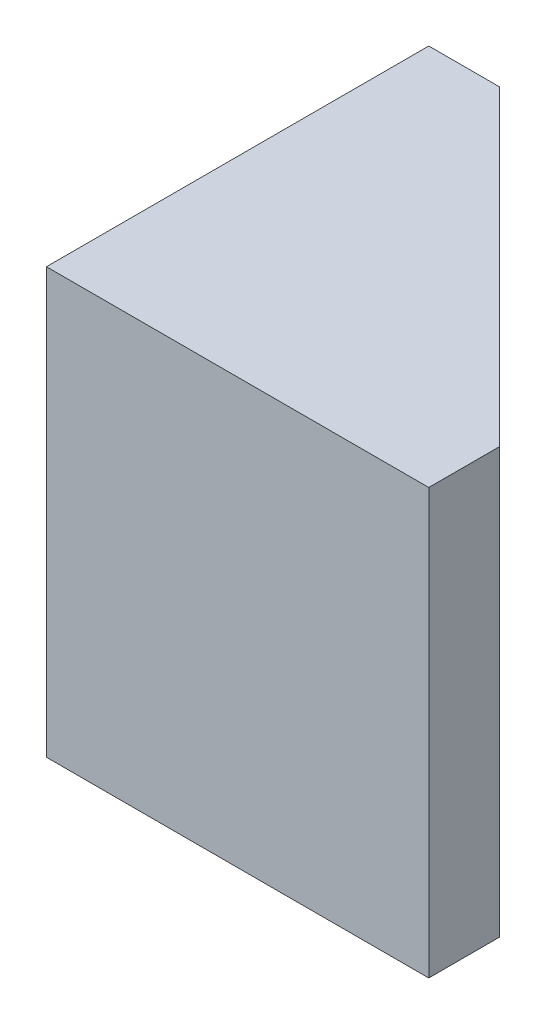
ISO-10303-21;
HEADER;
FILE_DESCRIPTION(('STEP AP214'),'2;1');
FILE_NAME('part.step','',(''),(''),'','','');
FILE_SCHEMA(('AUTOMOTIVE_DESIGN { 1 0 10303 214 1 1 1 1 }'));
ENDSEC;
DATA;
#1=APPLICATION_CONTEXT('core data for automotive mechanical design processes');
#2=APPLICATION_PROTOCOL_DEFINITION('international standard','automotive_design',2000,#1);
#3=PRODUCT_CONTEXT('',#1,'mechanical');
#4=PRODUCT('Part','Part','',(#3));
#5=PRODUCT_RELATED_PRODUCT_CATEGORY('part','',(#4));
#6=PRODUCT_DEFINITION_FORMATION('','',#4);
#7=PRODUCT_DEFINITION_CONTEXT('part definition',#1,'design');
#8=PRODUCT_DEFINITION('design','',#6,#7);
#9=PRODUCT_DEFINITION_SHAPE('','',#8);
#10=(LENGTH_UNIT() NAMED_UNIT(*) SI_UNIT(.MILLI.,.METRE.));
#11=(NAMED_UNIT(*) PLANE_ANGLE_UNIT() SI_UNIT($,.RADIAN.));
#12=(NAMED_UNIT(*) SI_UNIT($,.STERADIAN.) SOLID_ANGLE_UNIT());
#13=UNCERTAINTY_MEASURE_WITH_UNIT(LENGTH_MEASURE(1.E-05),#10,'distance_accuracy_value','');
#14=(GEOMETRIC_REPRESENTATION_CONTEXT(3) GLOBAL_UNCERTAINTY_ASSIGNED_CONTEXT((#13)) GLOBAL_UNIT_ASSIGNED_CONTEXT((#10,
#11,#12)) REPRESENTATION_CONTEXT('',''));
#15=CARTESIAN_POINT('',(0.,0.,0.));
#16=DIRECTION('',(0.,0.,1.));
#17=DIRECTION('',(1.,0.,0.));
#18=AXIS2_PLACEMENT_3D('',#15,#16,#17);
#19=CARTESIAN_POINT('',(32.,30.,0.));
#20=DIRECTION('',(0.,0.,-1.));
#21=DIRECTION('',(-1.,0.,0.));
#22=AXIS2_PLACEMENT_3D('',#19,#20,#21);
#23=PLANE('',#22);
#24=DIRECTION('',(1.,0.,0.));
#25=VECTOR('',#24,1.);
#26=CARTESIAN_POINT('',(32.,0.,0.));
#27=LINE('',#26,#25);
#28=CARTESIAN_POINT('',(0.,0.,0.));
#29=VERTEX_POINT('',#28);
#30=CARTESIAN_POINT('',(27.,0.,0.));
#31=VERTEX_POINT('',#30);
#32=EDGE_CURVE('E109',#29,#31,#27,.T.);
#33=ORIENTED_EDGE('',*,*,#32,.T.);
#34=DIRECTION('',(0.,1.,0.));
#35=VECTOR('',#34,1.);
#36=CARTESIAN_POINT('',(27.,0.,0.));
#37=LINE('',#36,#35);
#38=CARTESIAN_POINT('',(27.,30.,0.));
#39=VERTEX_POINT('',#38);
#40=EDGE_CURVE('E66',#31,#39,#37,.T.);
#41=ORIENTED_EDGE('',*,*,#40,.T.);
#42=DIRECTION('',(1.,0.,0.));
#43=VECTOR('',#42,1.);
#44=CARTESIAN_POINT('',(32.,30.,0.));
#45=LINE('',#44,#43);
#46=CARTESIAN_POINT('',(0.,30.,0.));
#47=VERTEX_POINT('',#46);
#48=EDGE_CURVE('E111',#47,#39,#45,.T.);
#49=ORIENTED_EDGE('',*,*,#48,.F.);
#50=DIRECTION('',(0.,-1.,0.));
#51=VECTOR('',#50,1.);
#52=CARTESIAN_POINT('',(0.,30.,0.));
#53=LINE('',#52,#51);
#54=EDGE_CURVE('E11',#47,#29,#53,.T.);
#55=ORIENTED_EDGE('',*,*,#54,.T.);
#56=EDGE_LOOP('',(#33,#41,#49,#55));
#57=FACE_BOUND('',#56,.T.);
#58=ADVANCED_FACE('F43',(#57),#23,.F.);
#59=CARTESIAN_POINT('',(0.,30.,-32.));
#60=DIRECTION('',(-0.707106781186547,0.,0.707106781186547));
#61=DIRECTION('',(0.707106781186548,0.,0.707106781186548));
#62=AXIS2_PLACEMENT_3D('',#59,#60,#61);
#63=PLANE('',#62);
#64=DIRECTION('',(-0.707106781186548,0.,-0.707106781186548));
#65=VECTOR('',#64,1.);
#66=CARTESIAN_POINT('',(0.,0.,-32.));
#67=LINE('',#66,#65);
#68=CARTESIAN_POINT('',(27.,0.,-5.0000000000001));
#69=VERTEX_POINT('',#68);
#70=CARTESIAN_POINT('',(5.,0.,-27.));
#71=VERTEX_POINT('',#70);
#72=EDGE_CURVE('E112',#69,#71,#67,.T.);
#73=ORIENTED_EDGE('',*,*,#72,.T.);
#74=DIRECTION('',(0.,1.,0.));
#75=VECTOR('',#74,1.);
#76=CARTESIAN_POINT('',(5.,0.,-27.));
#77=LINE('',#76,#75);
#78=CARTESIAN_POINT('',(5.,30.,-27.));
#79=VERTEX_POINT('',#78);
#80=EDGE_CURVE('E58',#71,#79,#77,.T.);
#81=ORIENTED_EDGE('',*,*,#80,.T.);
#82=DIRECTION('',(-0.707106781186548,0.,-0.707106781186548));
#83=VECTOR('',#82,1.);
#84=CARTESIAN_POINT('',(0.,30.,-32.));
#85=LINE('',#84,#83);
#86=CARTESIAN_POINT('',(27.,30.,-5.0000000000001));
#87=VERTEX_POINT('',#86);
#88=EDGE_CURVE('E116',#87,#79,#85,.T.);
#89=ORIENTED_EDGE('',*,*,#88,.F.);
#90=DIRECTION('',(0.,1.,0.));
#91=VECTOR('',#90,1.);
#92=CARTESIAN_POINT('',(27.,0.,-5.0000000000001));
#93=LINE('',#92,#91);
#94=EDGE_CURVE('E133',#69,#87,#93,.T.);
#95=ORIENTED_EDGE('',*,*,#94,.F.);
#96=EDGE_LOOP('',(#73,#81,#89,#95));
#97=FACE_BOUND('',#96,.T.);
#98=ADVANCED_FACE('F144',(#97),#63,.F.);
#99=CARTESIAN_POINT('',(0.,30.,0.));
#100=DIRECTION('',(1.,0.,0.));
#101=DIRECTION('',(0.,0.,-1.));
#102=AXIS2_PLACEMENT_3D('',#99,#100,#101);
#103=PLANE('',#102);
#104=DIRECTION('',(0.,0.,1.));
#105=VECTOR('',#104,1.);
#106=CARTESIAN_POINT('',(0.,30.,0.));
#107=LINE('',#106,#105);
#108=CARTESIAN_POINT('',(0.,30.,-27.));
#109=VERTEX_POINT('',#108);
#110=EDGE_CURVE('E51',#109,#47,#107,.T.);
#111=ORIENTED_EDGE('',*,*,#110,.F.);
#112=DIRECTION('',(0.,1.,0.));
#113=VECTOR('',#112,1.);
#114=CARTESIAN_POINT('',(0.,0.,-27.));
#115=LINE('',#114,#113);
#116=CARTESIAN_POINT('',(0.,0.,-27.));
#117=VERTEX_POINT('',#116);
#118=EDGE_CURVE('E90',#117,#109,#115,.T.);
#119=ORIENTED_EDGE('',*,*,#118,.F.);
#120=DIRECTION('',(0.,0.,1.));
#121=VECTOR('',#120,1.);
#122=CARTESIAN_POINT('',(0.,0.,0.));
#123=LINE('',#122,#121);
#124=EDGE_CURVE('E103',#117,#29,#123,.T.);
#125=ORIENTED_EDGE('',*,*,#124,.T.);
#126=ORIENTED_EDGE('',*,*,#54,.F.);
#127=EDGE_LOOP('',(#111,#119,#125,#126));
#128=FACE_BOUND('',#127,.T.);
#129=ADVANCED_FACE('F101',(#128),#103,.F.);
#130=CARTESIAN_POINT('',(0.,30.,0.));
#131=DIRECTION('',(0.,-1.,0.));
#132=DIRECTION('',(0.,0.,-1.));
#133=AXIS2_PLACEMENT_3D('',#130,#131,#132);
#134=PLANE('',#133);
#135=ORIENTED_EDGE('',*,*,#88,.T.);
#136=DIRECTION('',(1.,0.,0.));
#137=VECTOR('',#136,1.);
#138=CARTESIAN_POINT('',(0.,30.,-27.));
#139=LINE('',#138,#137);
#140=EDGE_CURVE('E97',#109,#79,#139,.T.);
#141=ORIENTED_EDGE('',*,*,#140,.F.);
#142=ORIENTED_EDGE('',*,*,#110,.T.);
#143=ORIENTED_EDGE('',*,*,#48,.T.);
#144=DIRECTION('',(0.,0.,1.));
#145=VECTOR('',#144,1.);
#146=CARTESIAN_POINT('',(27.,30.,0.));
#147=LINE('',#146,#145);
#148=EDGE_CURVE('E130',#87,#39,#147,.T.);
#149=ORIENTED_EDGE('',*,*,#148,.F.);
#150=EDGE_LOOP('',(#135,#141,#142,#143,#149));
#151=FACE_BOUND('',#150,.T.);
#152=ADVANCED_FACE('F147',(#151),#134,.F.);
#153=CARTESIAN_POINT('',(0.,0.,0.));
#154=DIRECTION('',(0.,-1.,0.));
#155=DIRECTION('',(0.,0.,-1.));
#156=AXIS2_PLACEMENT_3D('',#153,#154,#155);
#157=PLANE('',#156);
#158=DIRECTION('',(1.,0.,0.));
#159=VECTOR('',#158,1.);
#160=CARTESIAN_POINT('',(0.,0.,-27.));
#161=LINE('',#160,#159);
#162=EDGE_CURVE('E87',#117,#71,#161,.T.);
#163=ORIENTED_EDGE('',*,*,#162,.T.);
#164=ORIENTED_EDGE('',*,*,#72,.F.);
#165=DIRECTION('',(0.,0.,1.));
#166=VECTOR('',#165,1.);
#167=CARTESIAN_POINT('',(27.,0.,0.));
#168=LINE('',#167,#166);
#169=EDGE_CURVE('E127',#69,#31,#168,.T.);
#170=ORIENTED_EDGE('',*,*,#169,.T.);
#171=ORIENTED_EDGE('',*,*,#32,.F.);
#172=ORIENTED_EDGE('',*,*,#124,.F.);
#173=EDGE_LOOP('',(#163,#164,#170,#171,#172));
#174=FACE_BOUND('',#173,.T.);
#175=ADVANCED_FACE('F107',(#174),#157,.T.);
#176=CARTESIAN_POINT('',(27.,0.,0.));
#177=DIRECTION('',(-1.,0.,0.));
#178=DIRECTION('',(0.,0.,1.));
#179=AXIS2_PLACEMENT_3D('',#176,#177,#178);
#180=PLANE('',#179);
#181=ORIENTED_EDGE('',*,*,#148,.T.);
#182=ORIENTED_EDGE('',*,*,#40,.F.);
#183=ORIENTED_EDGE('',*,*,#169,.F.);
#184=ORIENTED_EDGE('',*,*,#94,.T.);
#185=EDGE_LOOP('',(#181,#182,#183,#184));
#186=FACE_BOUND('',#185,.T.);
#187=ADVANCED_FACE('F149',(#186),#180,.F.);
#188=CARTESIAN_POINT('',(0.,0.,-27.));
#189=DIRECTION('',(0.,0.,1.));
#190=DIRECTION('',(1.,0.,0.));
#191=AXIS2_PLACEMENT_3D('',#188,#189,#190);
#192=PLANE('',#191);
#193=ORIENTED_EDGE('',*,*,#140,.T.);
#194=ORIENTED_EDGE('',*,*,#80,.F.);
#195=ORIENTED_EDGE('',*,*,#162,.F.);
#196=ORIENTED_EDGE('',*,*,#118,.T.);
#197=EDGE_LOOP('',(#193,#194,#195,#196));
#198=FACE_BOUND('',#197,.T.);
#199=ADVANCED_FACE('F89',(#198),#192,.F.);
#200=CLOSED_SHELL('',(#58,#98,#129,#152,#175,#187,#199));
#201=MANIFOLD_SOLID_BREP('B2',#200);
#202=ADVANCED_BREP_SHAPE_REPRESENTATION('',(#18,#201),#14);
#203=SHAPE_DEFINITION_REPRESENTATION(#9,#202);
ENDSEC;
END-ISO-10303-21;
